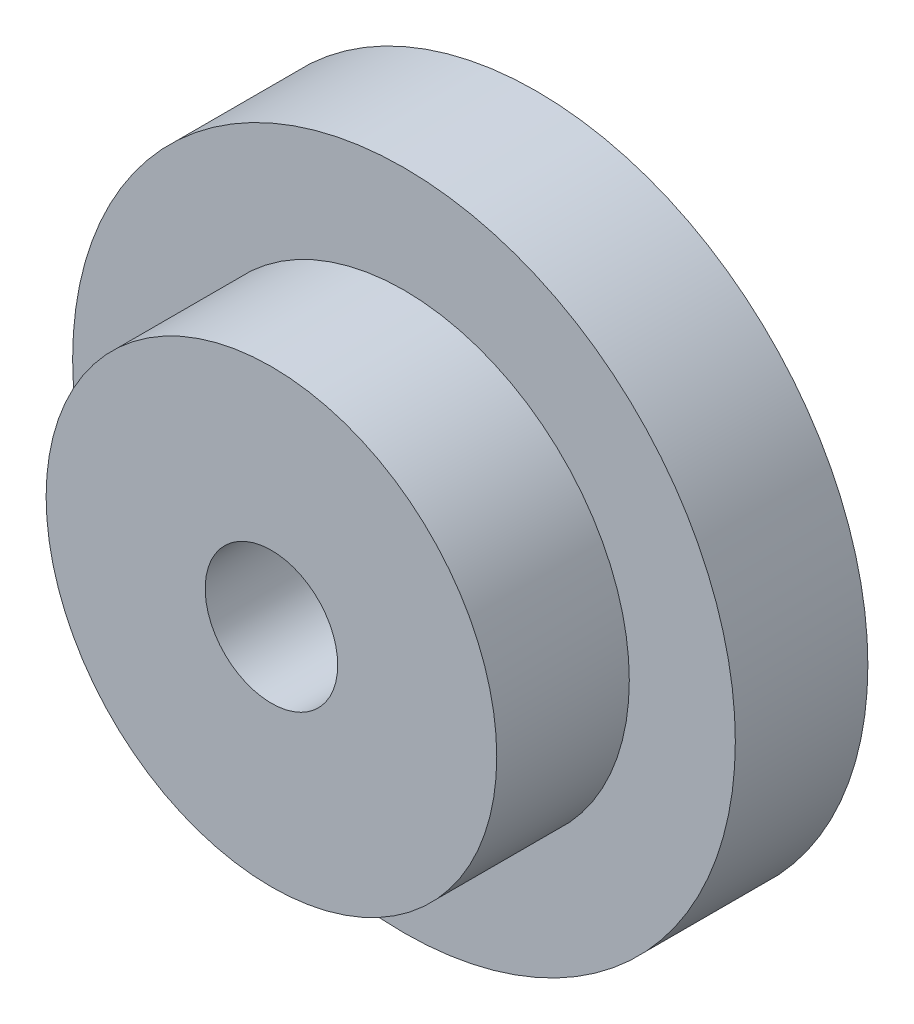
ISO-10303-21;
HEADER;
FILE_DESCRIPTION(('STEP AP214'),'2;1');
FILE_NAME('part.step','',(''),(''),'','','');
FILE_SCHEMA(('AUTOMOTIVE_DESIGN { 1 0 10303 214 1 1 1 1 }'));
ENDSEC;
DATA;
#1=APPLICATION_CONTEXT('core data for automotive mechanical design processes');
#2=APPLICATION_PROTOCOL_DEFINITION('international standard','automotive_design',2000,#1);
#3=PRODUCT_CONTEXT('',#1,'mechanical');
#4=PRODUCT('Part','Part','',(#3));
#5=PRODUCT_RELATED_PRODUCT_CATEGORY('part','',(#4));
#6=PRODUCT_DEFINITION_FORMATION('','',#4);
#7=PRODUCT_DEFINITION_CONTEXT('part definition',#1,'design');
#8=PRODUCT_DEFINITION('design','',#6,#7);
#9=PRODUCT_DEFINITION_SHAPE('','',#8);
#10=(LENGTH_UNIT() NAMED_UNIT(*) SI_UNIT(.MILLI.,.METRE.));
#11=(NAMED_UNIT(*) PLANE_ANGLE_UNIT() SI_UNIT($,.RADIAN.));
#12=(NAMED_UNIT(*) SI_UNIT($,.STERADIAN.) SOLID_ANGLE_UNIT());
#13=UNCERTAINTY_MEASURE_WITH_UNIT(LENGTH_MEASURE(1.E-05),#10,'distance_accuracy_value','');
#14=(GEOMETRIC_REPRESENTATION_CONTEXT(3) GLOBAL_UNCERTAINTY_ASSIGNED_CONTEXT((#13)) GLOBAL_UNIT_ASSIGNED_CONTEXT((#10,
#11,#12)) REPRESENTATION_CONTEXT('',''));
#15=CARTESIAN_POINT('',(0.,0.,0.));
#16=DIRECTION('',(0.,0.,1.));
#17=DIRECTION('',(1.,0.,0.));
#18=AXIS2_PLACEMENT_3D('',#15,#16,#17);
#19=CARTESIAN_POINT('',(0.,0.,1.));
#20=DIRECTION('',(0.,0.,1.));
#21=DIRECTION('',(1.,0.,0.));
#22=AXIS2_PLACEMENT_3D('',#19,#20,#21);
#23=PLANE('',#22);
#24=CARTESIAN_POINT('',(0.,0.,1.));
#25=DIRECTION('',(0.,0.,1.));
#26=DIRECTION('',(1.,0.,0.));
#27=AXIS2_PLACEMENT_3D('',#24,#25,#26);
#28=CIRCLE('',#27,1.7);
#29=CARTESIAN_POINT('',(1.7,0.,1.));
#30=VERTEX_POINT('',#29);
#31=EDGE_CURVE('E10',#30,#30,#28,.T.);
#32=ORIENTED_EDGE('',*,*,#31,.F.);
#33=EDGE_LOOP('',(#32));
#34=FACE_BOUND('',#33,.T.);
#35=CARTESIAN_POINT('',(0.,0.,1.));
#36=DIRECTION('',(0.,0.,1.));
#37=DIRECTION('',(1.,0.,0.));
#38=AXIS2_PLACEMENT_3D('',#35,#36,#37);
#39=CIRCLE('',#38,2.5);
#40=CARTESIAN_POINT('',(2.5,0.,1.));
#41=VERTEX_POINT('',#40);
#42=EDGE_CURVE('E44',#41,#41,#39,.T.);
#43=ORIENTED_EDGE('',*,*,#42,.T.);
#44=EDGE_LOOP('',(#43));
#45=FACE_BOUND('',#44,.T.);
#46=ADVANCED_FACE('F36',(#34,#45),#23,.T.);
#47=CARTESIAN_POINT('',(0.,0.,0.));
#48=DIRECTION('',(0.,0.,1.));
#49=DIRECTION('',(1.,0.,0.));
#50=AXIS2_PLACEMENT_3D('',#47,#48,#49);
#51=PLANE('',#50);
#52=CARTESIAN_POINT('',(0.,0.,0.));
#53=DIRECTION('',(0.,0.,1.));
#54=DIRECTION('',(1.,0.,0.));
#55=AXIS2_PLACEMENT_3D('',#52,#53,#54);
#56=CIRCLE('',#55,2.5);
#57=CARTESIAN_POINT('',(2.5,0.,0.));
#58=VERTEX_POINT('',#57);
#59=EDGE_CURVE('E40',#58,#58,#56,.T.);
#60=ORIENTED_EDGE('',*,*,#59,.F.);
#61=EDGE_LOOP('',(#60));
#62=FACE_BOUND('',#61,.T.);
#63=CARTESIAN_POINT('',(0.,0.,0.));
#64=DIRECTION('',(0.,0.,1.));
#65=DIRECTION('',(1.,0.,0.));
#66=AXIS2_PLACEMENT_3D('',#63,#64,#65);
#67=CIRCLE('',#66,0.5);
#68=CARTESIAN_POINT('',(0.5,0.,0.));
#69=VERTEX_POINT('',#68);
#70=EDGE_CURVE('E53',#69,#69,#67,.T.);
#71=ORIENTED_EDGE('',*,*,#70,.T.);
#72=EDGE_LOOP('',(#71));
#73=FACE_BOUND('',#72,.T.);
#74=ADVANCED_FACE('F80',(#62,#73),#51,.F.);
#75=CARTESIAN_POINT('',(0.,0.,1.));
#76=DIRECTION('',(0.,0.,-1.));
#77=DIRECTION('',(-1.,0.,0.));
#78=AXIS2_PLACEMENT_3D('',#75,#76,#77);
#79=CYLINDRICAL_SURFACE('',#78,2.5);
#80=ORIENTED_EDGE('',*,*,#42,.F.);
#81=EDGE_LOOP('',(#80));
#82=FACE_BOUND('',#81,.T.);
#83=ORIENTED_EDGE('',*,*,#59,.T.);
#84=EDGE_LOOP('',(#83));
#85=FACE_BOUND('',#84,.T.);
#86=ADVANCED_FACE('F38',(#82,#85),#79,.T.);
#87=CARTESIAN_POINT('',(0.,0.,1.));
#88=DIRECTION('',(0.,0.,-1.));
#89=DIRECTION('',(-1.,0.,0.));
#90=AXIS2_PLACEMENT_3D('',#87,#88,#89);
#91=CYLINDRICAL_SURFACE('',#90,0.5);
#92=ORIENTED_EDGE('',*,*,#70,.F.);
#93=EDGE_LOOP('',(#92));
#94=FACE_BOUND('',#93,.T.);
#95=CARTESIAN_POINT('',(0.,0.,2.));
#96=DIRECTION('',(0.,0.,1.));
#97=DIRECTION('',(1.,0.,0.));
#98=AXIS2_PLACEMENT_3D('',#95,#96,#97);
#99=CIRCLE('',#98,0.5);
#100=CARTESIAN_POINT('',(0.5,0.,2.));
#101=VERTEX_POINT('',#100);
#102=EDGE_CURVE('E59',#101,#101,#99,.T.);
#103=ORIENTED_EDGE('',*,*,#102,.T.);
#104=EDGE_LOOP('',(#103));
#105=FACE_BOUND('',#104,.T.);
#106=ADVANCED_FACE('F65',(#94,#105),#91,.F.);
#107=CARTESIAN_POINT('',(0.,0.,2.));
#108=DIRECTION('',(0.,0.,1.));
#109=DIRECTION('',(1.,0.,0.));
#110=AXIS2_PLACEMENT_3D('',#107,#108,#109);
#111=PLANE('',#110);
#112=CARTESIAN_POINT('',(0.,0.,2.));
#113=DIRECTION('',(0.,0.,1.));
#114=DIRECTION('',(1.,0.,0.));
#115=AXIS2_PLACEMENT_3D('',#112,#113,#114);
#116=CIRCLE('',#115,1.7);
#117=CARTESIAN_POINT('',(1.7,0.,2.));
#118=VERTEX_POINT('',#117);
#119=EDGE_CURVE('E51',#118,#118,#116,.T.);
#120=ORIENTED_EDGE('',*,*,#119,.T.);
#121=EDGE_LOOP('',(#120));
#122=FACE_BOUND('',#121,.T.);
#123=ORIENTED_EDGE('',*,*,#102,.F.);
#124=EDGE_LOOP('',(#123));
#125=FACE_BOUND('',#124,.T.);
#126=ADVANCED_FACE('F67',(#122,#125),#111,.T.);
#127=CARTESIAN_POINT('',(0.,0.,2.));
#128=DIRECTION('',(0.,0.,-1.));
#129=DIRECTION('',(-1.,0.,0.));
#130=AXIS2_PLACEMENT_3D('',#127,#128,#129);
#131=CYLINDRICAL_SURFACE('',#130,1.7);
#132=ORIENTED_EDGE('',*,*,#119,.F.);
#133=EDGE_LOOP('',(#132));
#134=FACE_BOUND('',#133,.T.);
#135=ORIENTED_EDGE('',*,*,#31,.T.);
#136=EDGE_LOOP('',(#135));
#137=FACE_BOUND('',#136,.T.);
#138=ADVANCED_FACE('F69',(#134,#137),#131,.T.);
#139=CLOSED_SHELL('',(#46,#74,#86,#106,#126,#138));
#140=MANIFOLD_SOLID_BREP('B2',#139);
#141=ADVANCED_BREP_SHAPE_REPRESENTATION('',(#18,#140),#14);
#142=SHAPE_DEFINITION_REPRESENTATION(#9,#141);
ENDSEC;
END-ISO-10303-21;
